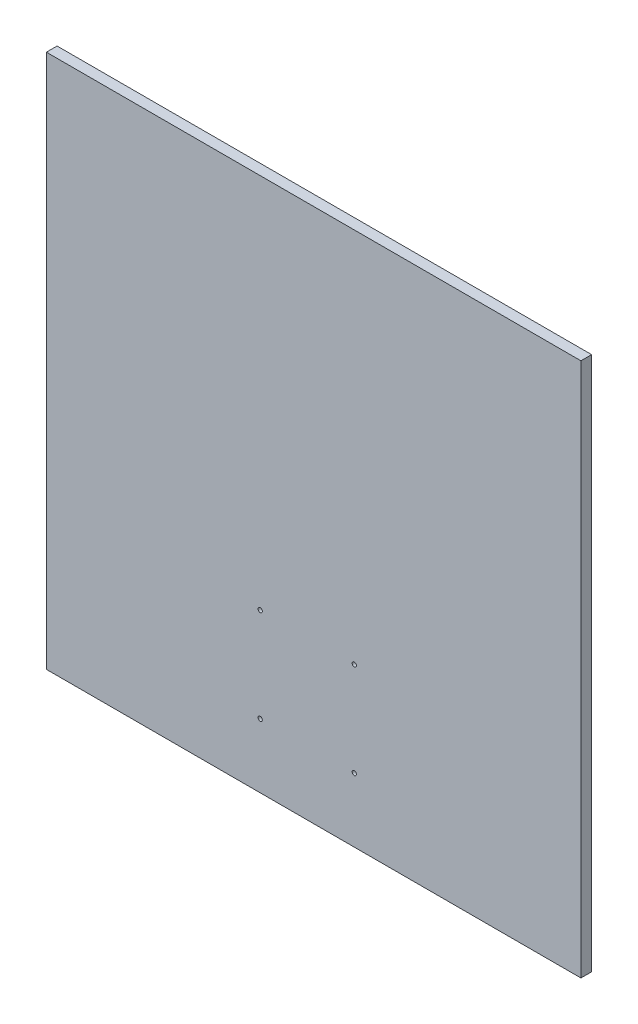
ISO-10303-21;
HEADER;
FILE_DESCRIPTION(('STEP AP214'),'2;1');
FILE_NAME('part.step','',(''),(''),'','','');
FILE_SCHEMA(('AUTOMOTIVE_DESIGN { 1 0 10303 214 1 1 1 1 }'));
ENDSEC;
DATA;
#1=APPLICATION_CONTEXT('core data for automotive mechanical design processes');
#2=APPLICATION_PROTOCOL_DEFINITION('international standard','automotive_design',2000,#1);
#3=PRODUCT_CONTEXT('',#1,'mechanical');
#4=PRODUCT('Part','Part','',(#3));
#5=PRODUCT_RELATED_PRODUCT_CATEGORY('part','',(#4));
#6=PRODUCT_DEFINITION_FORMATION('','',#4);
#7=PRODUCT_DEFINITION_CONTEXT('part definition',#1,'design');
#8=PRODUCT_DEFINITION('design','',#6,#7);
#9=PRODUCT_DEFINITION_SHAPE('','',#8);
#10=(LENGTH_UNIT() NAMED_UNIT(*) SI_UNIT(.MILLI.,.METRE.));
#11=(NAMED_UNIT(*) PLANE_ANGLE_UNIT() SI_UNIT($,.RADIAN.));
#12=(NAMED_UNIT(*) SI_UNIT($,.STERADIAN.) SOLID_ANGLE_UNIT());
#13=UNCERTAINTY_MEASURE_WITH_UNIT(LENGTH_MEASURE(1.E-05),#10,'distance_accuracy_value','');
#14=(GEOMETRIC_REPRESENTATION_CONTEXT(3) GLOBAL_UNCERTAINTY_ASSIGNED_CONTEXT((#13)) GLOBAL_UNIT_ASSIGNED_CONTEXT((#10,
#11,#12)) REPRESENTATION_CONTEXT('',''));
#15=CARTESIAN_POINT('',(0.,0.,0.));
#16=DIRECTION('',(0.,0.,1.));
#17=DIRECTION('',(1.,0.,0.));
#18=AXIS2_PLACEMENT_3D('',#15,#16,#17);
#19=CARTESIAN_POINT('',(0.,0.,5.));
#20=DIRECTION('',(0.,0.,-1.));
#21=DIRECTION('',(-1.,0.,0.));
#22=AXIS2_PLACEMENT_3D('',#19,#20,#21);
#23=PLANE('',#22);
#24=DIRECTION('',(0.,-1.,0.));
#25=VECTOR('',#24,1.);
#26=CARTESIAN_POINT('',(0.,0.,5.));
#27=LINE('',#26,#25);
#28=CARTESIAN_POINT('',(0.,250.,5.));
#29=VERTEX_POINT('',#28);
#30=CARTESIAN_POINT('',(0.,0.,5.));
#31=VERTEX_POINT('',#30);
#32=EDGE_CURVE('E85',#29,#31,#27,.T.);
#33=ORIENTED_EDGE('',*,*,#32,.T.);
#34=DIRECTION('',(1.,0.,0.));
#35=VECTOR('',#34,1.);
#36=CARTESIAN_POINT('',(0.,0.,5.));
#37=LINE('',#36,#35);
#38=CARTESIAN_POINT('',(250.,0.,5.));
#39=VERTEX_POINT('',#38);
#40=EDGE_CURVE('E80',#31,#39,#37,.T.);
#41=ORIENTED_EDGE('',*,*,#40,.T.);
#42=DIRECTION('',(0.,1.,0.));
#43=VECTOR('',#42,1.);
#44=CARTESIAN_POINT('',(250.,0.,5.));
#45=LINE('',#44,#43);
#46=CARTESIAN_POINT('',(250.,250.,5.));
#47=VERTEX_POINT('',#46);
#48=EDGE_CURVE('E83',#39,#47,#45,.T.);
#49=ORIENTED_EDGE('',*,*,#48,.T.);
#50=DIRECTION('',(-1.,0.,0.));
#51=VECTOR('',#50,1.);
#52=CARTESIAN_POINT('',(0.,250.,5.));
#53=LINE('',#52,#51);
#54=EDGE_CURVE('E50',#47,#29,#53,.T.);
#55=ORIENTED_EDGE('',*,*,#54,.T.);
#56=EDGE_LOOP('',(#33,#41,#49,#55));
#57=FACE_BOUND('',#56,.T.);
#58=CARTESIAN_POINT('',(100.,30.,5.));
#59=DIRECTION('',(0.,0.,1.));
#60=DIRECTION('',(1.,0.,0.));
#61=AXIS2_PLACEMENT_3D('',#58,#59,#60);
#62=CIRCLE('',#61,0.999999999999998);
#63=CARTESIAN_POINT('',(101.,30.,5.));
#64=VERTEX_POINT('',#63);
#65=EDGE_CURVE('E100',#64,#64,#62,.T.);
#66=ORIENTED_EDGE('',*,*,#65,.F.);
#67=EDGE_LOOP('',(#66));
#68=FACE_BOUND('',#67,.T.);
#69=CARTESIAN_POINT('',(144.,30.,5.));
#70=DIRECTION('',(0.,0.,1.));
#71=DIRECTION('',(1.,0.,0.));
#72=AXIS2_PLACEMENT_3D('',#69,#70,#71);
#73=CIRCLE('',#72,0.999999999999998);
#74=CARTESIAN_POINT('',(145.,30.,5.));
#75=VERTEX_POINT('',#74);
#76=EDGE_CURVE('E115',#75,#75,#73,.T.);
#77=ORIENTED_EDGE('',*,*,#76,.F.);
#78=EDGE_LOOP('',(#77));
#79=FACE_BOUND('',#78,.T.);
#80=CARTESIAN_POINT('',(144.,74.,5.));
#81=DIRECTION('',(0.,0.,1.));
#82=DIRECTION('',(1.,0.,0.));
#83=AXIS2_PLACEMENT_3D('',#80,#81,#82);
#84=CIRCLE('',#83,0.999999999999998);
#85=CARTESIAN_POINT('',(145.,74.,5.));
#86=VERTEX_POINT('',#85);
#87=EDGE_CURVE('E121',#86,#86,#84,.T.);
#88=ORIENTED_EDGE('',*,*,#87,.F.);
#89=EDGE_LOOP('',(#88));
#90=FACE_BOUND('',#89,.T.);
#91=CARTESIAN_POINT('',(99.9999999999999,74.,5.));
#92=DIRECTION('',(0.,0.,1.));
#93=DIRECTION('',(1.,0.,0.));
#94=AXIS2_PLACEMENT_3D('',#91,#92,#93);
#95=CIRCLE('',#94,0.999999999999998);
#96=CARTESIAN_POINT('',(101.,74.,5.));
#97=VERTEX_POINT('',#96);
#98=EDGE_CURVE('E127',#97,#97,#95,.T.);
#99=ORIENTED_EDGE('',*,*,#98,.F.);
#100=EDGE_LOOP('',(#99));
#101=FACE_BOUND('',#100,.T.);
#102=ADVANCED_FACE('F33',(#57,#68,#79,#90,#101),#23,.F.);
#103=CARTESIAN_POINT('',(0.,0.,0.));
#104=DIRECTION('',(0.,0.,-1.));
#105=DIRECTION('',(-1.,0.,0.));
#106=AXIS2_PLACEMENT_3D('',#103,#104,#105);
#107=PLANE('',#106);
#108=CARTESIAN_POINT('',(144.,74.,0.));
#109=DIRECTION('',(0.,0.,1.));
#110=DIRECTION('',(1.,0.,0.));
#111=AXIS2_PLACEMENT_3D('',#108,#109,#110);
#112=CIRCLE('',#111,0.999999999999998);
#113=CARTESIAN_POINT('',(145.,74.,0.));
#114=VERTEX_POINT('',#113);
#115=EDGE_CURVE('E124',#114,#114,#112,.T.);
#116=ORIENTED_EDGE('',*,*,#115,.T.);
#117=EDGE_LOOP('',(#116));
#118=FACE_BOUND('',#117,.T.);
#119=CARTESIAN_POINT('',(100.,30.,0.));
#120=DIRECTION('',(0.,0.,1.));
#121=DIRECTION('',(1.,0.,0.));
#122=AXIS2_PLACEMENT_3D('',#119,#120,#121);
#123=CIRCLE('',#122,0.999999999999998);
#124=CARTESIAN_POINT('',(101.,30.,0.));
#125=VERTEX_POINT('',#124);
#126=EDGE_CURVE('E112',#125,#125,#123,.T.);
#127=ORIENTED_EDGE('',*,*,#126,.T.);
#128=EDGE_LOOP('',(#127));
#129=FACE_BOUND('',#128,.T.);
#130=DIRECTION('',(0.,-1.,0.));
#131=VECTOR('',#130,1.);
#132=CARTESIAN_POINT('',(0.,0.,0.));
#133=LINE('',#132,#131);
#134=CARTESIAN_POINT('',(0.,250.,0.));
#135=VERTEX_POINT('',#134);
#136=CARTESIAN_POINT('',(0.,0.,0.));
#137=VERTEX_POINT('',#136);
#138=EDGE_CURVE('E97',#135,#137,#133,.T.);
#139=ORIENTED_EDGE('',*,*,#138,.F.);
#140=DIRECTION('',(-1.,0.,0.));
#141=VECTOR('',#140,1.);
#142=CARTESIAN_POINT('',(0.,250.,0.));
#143=LINE('',#142,#141);
#144=CARTESIAN_POINT('',(250.,250.,0.));
#145=VERTEX_POINT('',#144);
#146=EDGE_CURVE('E73',#145,#135,#143,.T.);
#147=ORIENTED_EDGE('',*,*,#146,.F.);
#148=DIRECTION('',(0.,1.,0.));
#149=VECTOR('',#148,1.);
#150=CARTESIAN_POINT('',(250.,0.,0.));
#151=LINE('',#150,#149);
#152=CARTESIAN_POINT('',(250.,0.,0.));
#153=VERTEX_POINT('',#152);
#154=EDGE_CURVE('E67',#153,#145,#151,.T.);
#155=ORIENTED_EDGE('',*,*,#154,.F.);
#156=DIRECTION('',(1.,0.,0.));
#157=VECTOR('',#156,1.);
#158=CARTESIAN_POINT('',(0.,0.,0.));
#159=LINE('',#158,#157);
#160=EDGE_CURVE('E89',#137,#153,#159,.T.);
#161=ORIENTED_EDGE('',*,*,#160,.F.);
#162=EDGE_LOOP('',(#139,#147,#155,#161));
#163=FACE_BOUND('',#162,.T.);
#164=CARTESIAN_POINT('',(144.,30.,0.));
#165=DIRECTION('',(0.,0.,1.));
#166=DIRECTION('',(1.,0.,0.));
#167=AXIS2_PLACEMENT_3D('',#164,#165,#166);
#168=CIRCLE('',#167,0.999999999999998);
#169=CARTESIAN_POINT('',(145.,30.,0.));
#170=VERTEX_POINT('',#169);
#171=EDGE_CURVE('E118',#170,#170,#168,.T.);
#172=ORIENTED_EDGE('',*,*,#171,.T.);
#173=EDGE_LOOP('',(#172));
#174=FACE_BOUND('',#173,.T.);
#175=CARTESIAN_POINT('',(99.9999999999999,74.,0.));
#176=DIRECTION('',(0.,0.,1.));
#177=DIRECTION('',(1.,0.,0.));
#178=AXIS2_PLACEMENT_3D('',#175,#176,#177);
#179=CIRCLE('',#178,0.999999999999998);
#180=CARTESIAN_POINT('',(101.,74.,0.));
#181=VERTEX_POINT('',#180);
#182=EDGE_CURVE('E130',#181,#181,#179,.T.);
#183=ORIENTED_EDGE('',*,*,#182,.T.);
#184=EDGE_LOOP('',(#183));
#185=FACE_BOUND('',#184,.T.);
#186=ADVANCED_FACE('F108',(#118,#129,#163,#174,#185),#107,.T.);
#187=CARTESIAN_POINT('',(0.,0.,5.));
#188=DIRECTION('',(1.,0.,0.));
#189=DIRECTION('',(0.,0.,-1.));
#190=AXIS2_PLACEMENT_3D('',#187,#188,#189);
#191=PLANE('',#190);
#192=ORIENTED_EDGE('',*,*,#138,.T.);
#193=DIRECTION('',(0.,0.,-1.));
#194=VECTOR('',#193,1.);
#195=CARTESIAN_POINT('',(0.,0.,5.));
#196=LINE('',#195,#194);
#197=EDGE_CURVE('E11',#31,#137,#196,.T.);
#198=ORIENTED_EDGE('',*,*,#197,.F.);
#199=ORIENTED_EDGE('',*,*,#32,.F.);
#200=DIRECTION('',(0.,0.,-1.));
#201=VECTOR('',#200,1.);
#202=CARTESIAN_POINT('',(0.,250.,5.));
#203=LINE('',#202,#201);
#204=EDGE_CURVE('E93',#29,#135,#203,.T.);
#205=ORIENTED_EDGE('',*,*,#204,.T.);
#206=EDGE_LOOP('',(#192,#198,#199,#205));
#207=FACE_BOUND('',#206,.T.);
#208=ADVANCED_FACE('F35',(#207),#191,.F.);
#209=CARTESIAN_POINT('',(0.,0.,5.));
#210=DIRECTION('',(0.,1.,0.));
#211=DIRECTION('',(0.,0.,1.));
#212=AXIS2_PLACEMENT_3D('',#209,#210,#211);
#213=PLANE('',#212);
#214=ORIENTED_EDGE('',*,*,#160,.T.);
#215=DIRECTION('',(0.,0.,-1.));
#216=VECTOR('',#215,1.);
#217=CARTESIAN_POINT('',(250.,0.,5.));
#218=LINE('',#217,#216);
#219=EDGE_CURVE('E42',#39,#153,#218,.T.);
#220=ORIENTED_EDGE('',*,*,#219,.F.);
#221=ORIENTED_EDGE('',*,*,#40,.F.);
#222=ORIENTED_EDGE('',*,*,#197,.T.);
#223=EDGE_LOOP('',(#214,#220,#221,#222));
#224=FACE_BOUND('',#223,.T.);
#225=ADVANCED_FACE('F88',(#224),#213,.F.);
#226=CARTESIAN_POINT('',(250.,0.,5.));
#227=DIRECTION('',(-1.,0.,0.));
#228=DIRECTION('',(0.,0.,1.));
#229=AXIS2_PLACEMENT_3D('',#226,#227,#228);
#230=PLANE('',#229);
#231=ORIENTED_EDGE('',*,*,#154,.T.);
#232=DIRECTION('',(0.,0.,-1.));
#233=VECTOR('',#232,1.);
#234=CARTESIAN_POINT('',(250.,250.,5.));
#235=LINE('',#234,#233);
#236=EDGE_CURVE('E90',#47,#145,#235,.T.);
#237=ORIENTED_EDGE('',*,*,#236,.F.);
#238=ORIENTED_EDGE('',*,*,#48,.F.);
#239=ORIENTED_EDGE('',*,*,#219,.T.);
#240=EDGE_LOOP('',(#231,#237,#238,#239));
#241=FACE_BOUND('',#240,.T.);
#242=ADVANCED_FACE('F91',(#241),#230,.F.);
#243=CARTESIAN_POINT('',(0.,250.,5.));
#244=DIRECTION('',(0.,-1.,0.));
#245=DIRECTION('',(0.,0.,-1.));
#246=AXIS2_PLACEMENT_3D('',#243,#244,#245);
#247=PLANE('',#246);
#248=ORIENTED_EDGE('',*,*,#146,.T.);
#249=ORIENTED_EDGE('',*,*,#204,.F.);
#250=ORIENTED_EDGE('',*,*,#54,.F.);
#251=ORIENTED_EDGE('',*,*,#236,.T.);
#252=EDGE_LOOP('',(#248,#249,#250,#251));
#253=FACE_BOUND('',#252,.T.);
#254=ADVANCED_FACE('F105',(#253),#247,.F.);
#255=CARTESIAN_POINT('',(100.,30.,5.));
#256=DIRECTION('',(0.,0.,-1.));
#257=DIRECTION('',(-1.,0.,0.));
#258=AXIS2_PLACEMENT_3D('',#255,#256,#257);
#259=CYLINDRICAL_SURFACE('',#258,0.999999999999998);
#260=ORIENTED_EDGE('',*,*,#65,.T.);
#261=EDGE_LOOP('',(#260));
#262=FACE_BOUND('',#261,.T.);
#263=ORIENTED_EDGE('',*,*,#126,.F.);
#264=EDGE_LOOP('',(#263));
#265=FACE_BOUND('',#264,.T.);
#266=ADVANCED_FACE('F147',(#262,#265),#259,.F.);
#267=CARTESIAN_POINT('',(144.,30.,5.));
#268=DIRECTION('',(0.,0.,-1.));
#269=DIRECTION('',(-1.,0.,0.));
#270=AXIS2_PLACEMENT_3D('',#267,#268,#269);
#271=CYLINDRICAL_SURFACE('',#270,0.999999999999998);
#272=ORIENTED_EDGE('',*,*,#76,.T.);
#273=EDGE_LOOP('',(#272));
#274=FACE_BOUND('',#273,.T.);
#275=ORIENTED_EDGE('',*,*,#171,.F.);
#276=EDGE_LOOP('',(#275));
#277=FACE_BOUND('',#276,.T.);
#278=ADVANCED_FACE('F193',(#274,#277),#271,.F.);
#279=CARTESIAN_POINT('',(144.,74.,5.));
#280=DIRECTION('',(0.,0.,-1.));
#281=DIRECTION('',(-1.,0.,0.));
#282=AXIS2_PLACEMENT_3D('',#279,#280,#281);
#283=CYLINDRICAL_SURFACE('',#282,0.999999999999998);
#284=ORIENTED_EDGE('',*,*,#87,.T.);
#285=EDGE_LOOP('',(#284));
#286=FACE_BOUND('',#285,.T.);
#287=ORIENTED_EDGE('',*,*,#115,.F.);
#288=EDGE_LOOP('',(#287));
#289=FACE_BOUND('',#288,.T.);
#290=ADVANCED_FACE('F201',(#286,#289),#283,.F.);
#291=CARTESIAN_POINT('',(99.9999999999999,74.,5.));
#292=DIRECTION('',(0.,0.,-1.));
#293=DIRECTION('',(-1.,0.,0.));
#294=AXIS2_PLACEMENT_3D('',#291,#292,#293);
#295=CYLINDRICAL_SURFACE('',#294,0.999999999999998);
#296=ORIENTED_EDGE('',*,*,#98,.T.);
#297=EDGE_LOOP('',(#296));
#298=FACE_BOUND('',#297,.T.);
#299=ORIENTED_EDGE('',*,*,#182,.F.);
#300=EDGE_LOOP('',(#299));
#301=FACE_BOUND('',#300,.T.);
#302=ADVANCED_FACE('F136',(#298,#301),#295,.F.);
#303=CLOSED_SHELL('',(#102,#186,#208,#225,#242,#254,#266,#278,#290,#302));
#304=MANIFOLD_SOLID_BREP('B2',#303);
#305=ADVANCED_BREP_SHAPE_REPRESENTATION('',(#18,#304),#14);
#306=SHAPE_DEFINITION_REPRESENTATION(#9,#305);
ENDSEC;
END-ISO-10303-21;
